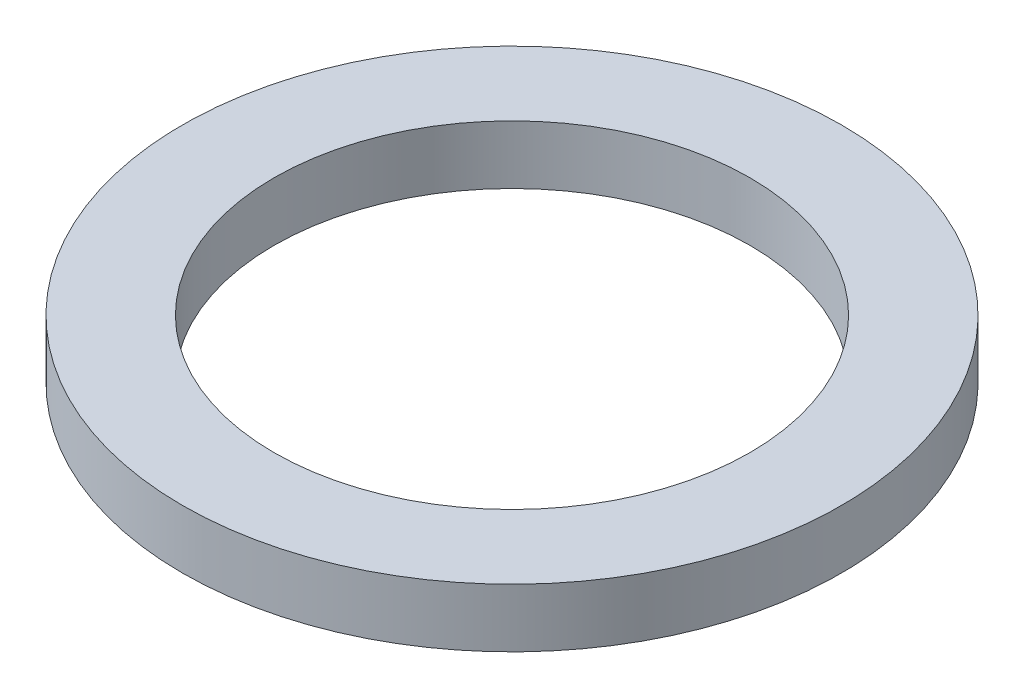
ISO-10303-21;
HEADER;
FILE_DESCRIPTION(('STEP AP214'),'2;1');
FILE_NAME('part.step','',(''),(''),'','','');
FILE_SCHEMA(('AUTOMOTIVE_DESIGN { 1 0 10303 214 1 1 1 1 }'));
ENDSEC;
DATA;
#1=APPLICATION_CONTEXT('core data for automotive mechanical design processes');
#2=APPLICATION_PROTOCOL_DEFINITION('international standard','automotive_design',2000,#1);
#3=PRODUCT_CONTEXT('',#1,'mechanical');
#4=PRODUCT('Part','Part','',(#3));
#5=PRODUCT_RELATED_PRODUCT_CATEGORY('part','',(#4));
#6=PRODUCT_DEFINITION_FORMATION('','',#4);
#7=PRODUCT_DEFINITION_CONTEXT('part definition',#1,'design');
#8=PRODUCT_DEFINITION('design','',#6,#7);
#9=PRODUCT_DEFINITION_SHAPE('','',#8);
#10=(LENGTH_UNIT() NAMED_UNIT(*) SI_UNIT(.MILLI.,.METRE.));
#11=(NAMED_UNIT(*) PLANE_ANGLE_UNIT() SI_UNIT($,.RADIAN.));
#12=(NAMED_UNIT(*) SI_UNIT($,.STERADIAN.) SOLID_ANGLE_UNIT());
#13=UNCERTAINTY_MEASURE_WITH_UNIT(LENGTH_MEASURE(1.E-05),#10,'distance_accuracy_value','');
#14=(GEOMETRIC_REPRESENTATION_CONTEXT(3) GLOBAL_UNCERTAINTY_ASSIGNED_CONTEXT((#13)) GLOBAL_UNIT_ASSIGNED_CONTEXT((#10,
#11,#12)) REPRESENTATION_CONTEXT('',''));
#15=CARTESIAN_POINT('',(0.,0.,0.));
#16=DIRECTION('',(0.,0.,1.));
#17=DIRECTION('',(1.,0.,0.));
#18=AXIS2_PLACEMENT_3D('',#15,#16,#17);
#19=CARTESIAN_POINT('',(0.,8.,0.));
#20=DIRECTION('',(0.,-1.,0.));
#21=DIRECTION('',(0.,0.,-1.));
#22=AXIS2_PLACEMENT_3D('',#19,#20,#21);
#23=CYLINDRICAL_SURFACE('',#22,45.);
#24=CARTESIAN_POINT('',(0.,8.,0.));
#25=DIRECTION('',(0.,1.,0.));
#26=DIRECTION('',(0.,0.,1.));
#27=AXIS2_PLACEMENT_3D('',#24,#25,#26);
#28=CIRCLE('',#27,45.);
#29=CARTESIAN_POINT('',(0.,8.,45.));
#30=VERTEX_POINT('',#29);
#31=EDGE_CURVE('E10',#30,#30,#28,.T.);
#32=ORIENTED_EDGE('',*,*,#31,.F.);
#33=EDGE_LOOP('',(#32));
#34=FACE_BOUND('',#33,.T.);
#35=CARTESIAN_POINT('',(0.,0.,0.));
#36=DIRECTION('',(0.,1.,0.));
#37=DIRECTION('',(0.,0.,1.));
#38=AXIS2_PLACEMENT_3D('',#35,#36,#37);
#39=CIRCLE('',#38,45.);
#40=CARTESIAN_POINT('',(0.,0.,45.));
#41=VERTEX_POINT('',#40);
#42=EDGE_CURVE('E37',#41,#41,#39,.T.);
#43=ORIENTED_EDGE('',*,*,#42,.T.);
#44=EDGE_LOOP('',(#43));
#45=FACE_BOUND('',#44,.T.);
#46=ADVANCED_FACE('F40',(#34,#45),#23,.T.);
#47=CARTESIAN_POINT('',(0.,8.,0.));
#48=DIRECTION('',(0.,1.,0.));
#49=DIRECTION('',(0.,0.,1.));
#50=AXIS2_PLACEMENT_3D('',#47,#48,#49);
#51=PLANE('',#50);
#52=CARTESIAN_POINT('',(0.,8.,0.));
#53=DIRECTION('',(0.,1.,0.));
#54=DIRECTION('',(0.,0.,1.));
#55=AXIS2_PLACEMENT_3D('',#52,#53,#54);
#56=CIRCLE('',#55,32.5);
#57=CARTESIAN_POINT('',(0.,8.,32.5));
#58=VERTEX_POINT('',#57);
#59=EDGE_CURVE('E50',#58,#58,#56,.T.);
#60=ORIENTED_EDGE('',*,*,#59,.F.);
#61=EDGE_LOOP('',(#60));
#62=FACE_BOUND('',#61,.T.);
#63=ORIENTED_EDGE('',*,*,#31,.T.);
#64=EDGE_LOOP('',(#63));
#65=FACE_BOUND('',#64,.T.);
#66=ADVANCED_FACE('F59',(#62,#65),#51,.T.);
#67=CARTESIAN_POINT('',(0.,0.,0.));
#68=DIRECTION('',(0.,1.,0.));
#69=DIRECTION('',(0.,0.,1.));
#70=AXIS2_PLACEMENT_3D('',#67,#68,#69);
#71=PLANE('',#70);
#72=CARTESIAN_POINT('',(0.,0.,0.));
#73=DIRECTION('',(0.,1.,0.));
#74=DIRECTION('',(0.,0.,1.));
#75=AXIS2_PLACEMENT_3D('',#72,#73,#74);
#76=CIRCLE('',#75,32.5);
#77=CARTESIAN_POINT('',(0.,0.,32.5));
#78=VERTEX_POINT('',#77);
#79=EDGE_CURVE('E47',#78,#78,#76,.T.);
#80=ORIENTED_EDGE('',*,*,#79,.T.);
#81=EDGE_LOOP('',(#80));
#82=FACE_BOUND('',#81,.T.);
#83=ORIENTED_EDGE('',*,*,#42,.F.);
#84=EDGE_LOOP('',(#83));
#85=FACE_BOUND('',#84,.T.);
#86=ADVANCED_FACE('F58',(#82,#85),#71,.F.);
#87=CARTESIAN_POINT('',(0.,8.,0.));
#88=DIRECTION('',(0.,-1.,0.));
#89=DIRECTION('',(0.,0.,-1.));
#90=AXIS2_PLACEMENT_3D('',#87,#88,#89);
#91=CYLINDRICAL_SURFACE('',#90,32.5);
#92=ORIENTED_EDGE('',*,*,#59,.T.);
#93=EDGE_LOOP('',(#92));
#94=FACE_BOUND('',#93,.T.);
#95=ORIENTED_EDGE('',*,*,#79,.F.);
#96=EDGE_LOOP('',(#95));
#97=FACE_BOUND('',#96,.T.);
#98=ADVANCED_FACE('F54',(#94,#97),#91,.F.);
#99=CLOSED_SHELL('',(#46,#66,#86,#98));
#100=MANIFOLD_SOLID_BREP('B2',#99);
#101=ADVANCED_BREP_SHAPE_REPRESENTATION('',(#18,#100),#14);
#102=SHAPE_DEFINITION_REPRESENTATION(#9,#101);
ENDSEC;
END-ISO-10303-21;
